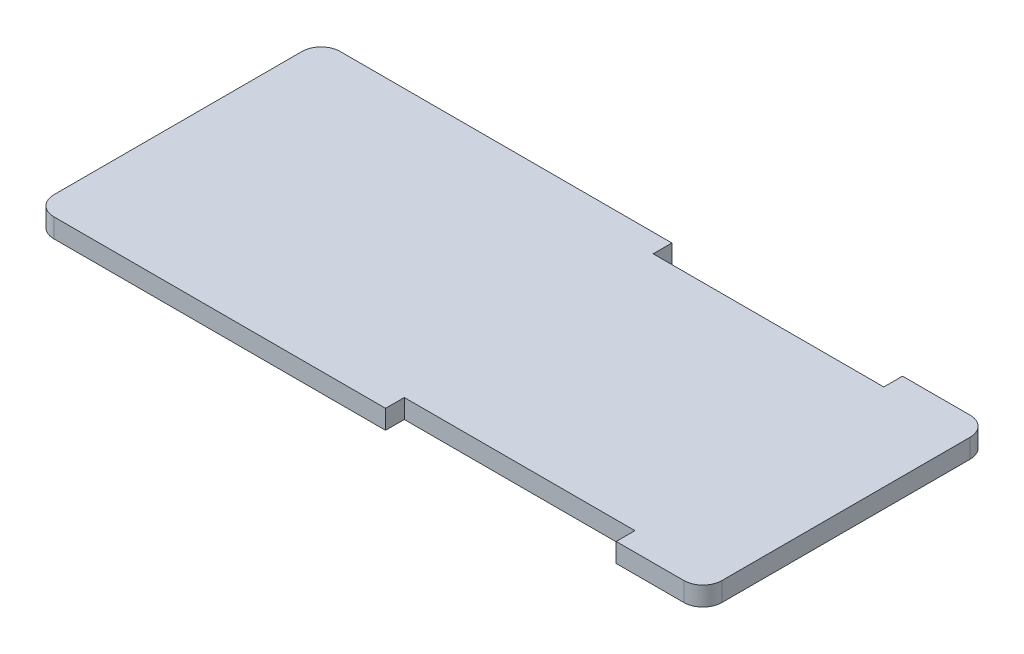
ISO-10303-21;
HEADER;
FILE_DESCRIPTION(('STEP AP214'),'2;1');
FILE_NAME('part.step','',(''),(''),'','','');
FILE_SCHEMA(('AUTOMOTIVE_DESIGN { 1 0 10303 214 1 1 1 1 }'));
ENDSEC;
DATA;
#1=APPLICATION_CONTEXT('core data for automotive mechanical design processes');
#2=APPLICATION_PROTOCOL_DEFINITION('international standard','automotive_design',2000,#1);
#3=PRODUCT_CONTEXT('',#1,'mechanical');
#4=PRODUCT('Part','Part','',(#3));
#5=PRODUCT_RELATED_PRODUCT_CATEGORY('part','',(#4));
#6=PRODUCT_DEFINITION_FORMATION('','',#4);
#7=PRODUCT_DEFINITION_CONTEXT('part definition',#1,'design');
#8=PRODUCT_DEFINITION('design','',#6,#7);
#9=PRODUCT_DEFINITION_SHAPE('','',#8);
#10=(LENGTH_UNIT() NAMED_UNIT(*) SI_UNIT(.MILLI.,.METRE.));
#11=(NAMED_UNIT(*) PLANE_ANGLE_UNIT() SI_UNIT($,.RADIAN.));
#12=(NAMED_UNIT(*) SI_UNIT($,.STERADIAN.) SOLID_ANGLE_UNIT());
#13=UNCERTAINTY_MEASURE_WITH_UNIT(LENGTH_MEASURE(1.E-05),#10,'distance_accuracy_value','');
#14=(GEOMETRIC_REPRESENTATION_CONTEXT(3) GLOBAL_UNCERTAINTY_ASSIGNED_CONTEXT((#13)) GLOBAL_UNIT_ASSIGNED_CONTEXT((#10,
#11,#12)) REPRESENTATION_CONTEXT('',''));
#15=CARTESIAN_POINT('',(0.,0.,0.));
#16=DIRECTION('',(0.,0.,1.));
#17=DIRECTION('',(1.,0.,0.));
#18=AXIS2_PLACEMENT_3D('',#15,#16,#17);
#19=CARTESIAN_POINT('',(0.,10.,150.));
#20=DIRECTION('',(0.,0.,-1.));
#21=DIRECTION('',(-1.,0.,0.));
#22=AXIS2_PLACEMENT_3D('',#19,#20,#21);
#23=PLANE('',#22);
#24=DIRECTION('',(0.,1.,0.));
#25=VECTOR('',#24,1.);
#26=CARTESIAN_POINT('',(183.760334018558,-15.,150.));
#27=LINE('',#26,#25);
#28=CARTESIAN_POINT('',(183.760334018558,0.,150.));
#29=VERTEX_POINT('',#28);
#30=CARTESIAN_POINT('',(183.760334018558,10.,150.));
#31=VERTEX_POINT('',#30);
#32=EDGE_CURVE('E151',#29,#31,#27,.T.);
#33=ORIENTED_EDGE('',*,*,#32,.T.);
#34=DIRECTION('',(1.,0.,0.));
#35=VECTOR('',#34,1.);
#36=CARTESIAN_POINT('',(0.,10.,150.));
#37=LINE('',#36,#35);
#38=CARTESIAN_POINT('',(10.,10.,150.));
#39=VERTEX_POINT('',#38);
#40=EDGE_CURVE('E166',#39,#31,#37,.T.);
#41=ORIENTED_EDGE('',*,*,#40,.F.);
#42=DIRECTION('',(0.,-1.,0.));
#43=VECTOR('',#42,1.);
#44=CARTESIAN_POINT('',(10.,10.,150.));
#45=LINE('',#44,#43);
#46=CARTESIAN_POINT('',(10.,0.,150.));
#47=VERTEX_POINT('',#46);
#48=EDGE_CURVE('E233',#39,#47,#45,.T.);
#49=ORIENTED_EDGE('',*,*,#48,.T.);
#50=DIRECTION('',(1.,0.,0.));
#51=VECTOR('',#50,1.);
#52=CARTESIAN_POINT('',(0.,0.,150.));
#53=LINE('',#52,#51);
#54=EDGE_CURVE('E169',#47,#29,#53,.T.);
#55=ORIENTED_EDGE('',*,*,#54,.T.);
#56=EDGE_LOOP('',(#33,#41,#49,#55));
#57=FACE_BOUND('',#56,.T.);
#58=ADVANCED_FACE('F37',(#57),#23,.F.);
#59=CARTESIAN_POINT('',(0.,10.,0.));
#60=DIRECTION('',(0.,0.,1.));
#61=DIRECTION('',(1.,0.,0.));
#62=AXIS2_PLACEMENT_3D('',#59,#60,#61);
#63=PLANE('',#62);
#64=DIRECTION('',(0.,1.,0.));
#65=VECTOR('',#64,1.);
#66=CARTESIAN_POINT('',(304.58142198421,-15.,0.));
#67=LINE('',#66,#65);
#68=CARTESIAN_POINT('',(304.58142198421,0.,0.));
#69=VERTEX_POINT('',#68);
#70=CARTESIAN_POINT('',(304.58142198421,10.,0.));
#71=VERTEX_POINT('',#70);
#72=EDGE_CURVE('E269',#69,#71,#67,.T.);
#73=ORIENTED_EDGE('',*,*,#72,.T.);
#74=DIRECTION('',(-1.,0.,0.));
#75=VECTOR('',#74,1.);
#76=CARTESIAN_POINT('',(0.,10.,0.));
#77=LINE('',#76,#75);
#78=CARTESIAN_POINT('',(340.,10.,0.));
#79=VERTEX_POINT('',#78);
#80=EDGE_CURVE('E187',#79,#71,#77,.T.);
#81=ORIENTED_EDGE('',*,*,#80,.F.);
#82=DIRECTION('',(0.,-1.,0.));
#83=VECTOR('',#82,1.);
#84=CARTESIAN_POINT('',(340.,10.,0.));
#85=LINE('',#84,#83);
#86=CARTESIAN_POINT('',(340.,0.,0.));
#87=VERTEX_POINT('',#86);
#88=EDGE_CURVE('E217',#79,#87,#85,.T.);
#89=ORIENTED_EDGE('',*,*,#88,.T.);
#90=DIRECTION('',(-1.,0.,0.));
#91=VECTOR('',#90,1.);
#92=CARTESIAN_POINT('',(0.,0.,0.));
#93=LINE('',#92,#91);
#94=EDGE_CURVE('E200',#87,#69,#93,.T.);
#95=ORIENTED_EDGE('',*,*,#94,.T.);
#96=EDGE_LOOP('',(#73,#81,#89,#95));
#97=FACE_BOUND('',#96,.T.);
#98=ADVANCED_FACE('F276',(#97),#63,.F.);
#99=CARTESIAN_POINT('',(0.,10.,0.));
#100=DIRECTION('',(0.,1.,0.));
#101=DIRECTION('',(0.,0.,1.));
#102=AXIS2_PLACEMENT_3D('',#99,#100,#101);
#103=PLANE('',#102);
#104=ORIENTED_EDGE('',*,*,#40,.T.);
#105=DIRECTION('',(0.,0.,-1.));
#106=VECTOR('',#105,1.);
#107=CARTESIAN_POINT('',(183.760334018558,10.,0.));
#108=LINE('',#107,#106);
#109=CARTESIAN_POINT('',(183.760334018558,10.,140.183233788463));
#110=VERTEX_POINT('',#109);
#111=EDGE_CURVE('E148',#31,#110,#108,.T.);
#112=ORIENTED_EDGE('',*,*,#111,.T.);
#113=DIRECTION('',(-1.,0.,0.));
#114=VECTOR('',#113,1.);
#115=CARTESIAN_POINT('',(0.,10.,140.183233788463));
#116=LINE('',#115,#114);
#117=CARTESIAN_POINT('',(304.58142198421,10.,140.183233788463));
#118=VERTEX_POINT('',#117);
#119=EDGE_CURVE('E171',#118,#110,#116,.T.);
#120=ORIENTED_EDGE('',*,*,#119,.F.);
#121=DIRECTION('',(0.,0.,-1.));
#122=VECTOR('',#121,1.);
#123=CARTESIAN_POINT('',(304.58142198421,10.,0.));
#124=LINE('',#123,#122);
#125=CARTESIAN_POINT('',(304.58142198421,10.,150.));
#126=VERTEX_POINT('',#125);
#127=EDGE_CURVE('E159',#126,#118,#124,.T.);
#128=ORIENTED_EDGE('',*,*,#127,.F.);
#129=CARTESIAN_POINT('',(340.,10.,150.));
#130=VERTEX_POINT('',#129);
#131=EDGE_CURVE('E178',#126,#130,#37,.T.);
#132=ORIENTED_EDGE('',*,*,#131,.T.);
#133=CARTESIAN_POINT('',(340.,10.,140.));
#134=DIRECTION('',(0.,1.,0.));
#135=DIRECTION('',(0.,0.,1.));
#136=AXIS2_PLACEMENT_3D('',#133,#134,#135);
#137=CIRCLE('',#136,10.);
#138=CARTESIAN_POINT('',(350.,10.,140.));
#139=VERTEX_POINT('',#138);
#140=EDGE_CURVE('E223',#130,#139,#137,.T.);
#141=ORIENTED_EDGE('',*,*,#140,.T.);
#142=DIRECTION('',(0.,0.,-1.));
#143=VECTOR('',#142,1.);
#144=CARTESIAN_POINT('',(350.,10.,0.));
#145=LINE('',#144,#143);
#146=CARTESIAN_POINT('',(350.,10.,10.));
#147=VERTEX_POINT('',#146);
#148=EDGE_CURVE('E177',#139,#147,#145,.T.);
#149=ORIENTED_EDGE('',*,*,#148,.T.);
#150=CARTESIAN_POINT('',(340.,10.,10.));
#151=DIRECTION('',(0.,1.,0.));
#152=DIRECTION('',(0.,0.,1.));
#153=AXIS2_PLACEMENT_3D('',#150,#151,#152);
#154=CIRCLE('',#153,10.);
#155=EDGE_CURVE('E225',#147,#79,#154,.T.);
#156=ORIENTED_EDGE('',*,*,#155,.T.);
#157=ORIENTED_EDGE('',*,*,#80,.T.);
#158=DIRECTION('',(0.,0.,1.));
#159=VECTOR('',#158,1.);
#160=CARTESIAN_POINT('',(304.58142198421,10.,0.));
#161=LINE('',#160,#159);
#162=CARTESIAN_POINT('',(304.58142198421,10.,9.81676621153724));
#163=VERTEX_POINT('',#162);
#164=EDGE_CURVE('E261',#71,#163,#161,.T.);
#165=ORIENTED_EDGE('',*,*,#164,.T.);
#166=DIRECTION('',(-1.,0.,0.));
#167=VECTOR('',#166,1.);
#168=CARTESIAN_POINT('',(0.,10.,9.81676621153724));
#169=LINE('',#168,#167);
#170=CARTESIAN_POINT('',(183.760334018558,10.,9.81676621153724));
#171=VERTEX_POINT('',#170);
#172=EDGE_CURVE('E266',#163,#171,#169,.T.);
#173=ORIENTED_EDGE('',*,*,#172,.T.);
#174=DIRECTION('',(0.,0.,1.));
#175=VECTOR('',#174,1.);
#176=CARTESIAN_POINT('',(183.760334018558,10.,0.));
#177=LINE('',#176,#175);
#178=CARTESIAN_POINT('',(183.760334018558,10.,0.));
#179=VERTEX_POINT('',#178);
#180=EDGE_CURVE('E264',#179,#171,#177,.T.);
#181=ORIENTED_EDGE('',*,*,#180,.F.);
#182=CARTESIAN_POINT('',(10.,10.,0.));
#183=VERTEX_POINT('',#182);
#184=EDGE_CURVE('E181',#179,#183,#77,.T.);
#185=ORIENTED_EDGE('',*,*,#184,.T.);
#186=CARTESIAN_POINT('',(10.,10.,10.));
#187=DIRECTION('',(0.,1.,0.));
#188=DIRECTION('',(0.,0.,1.));
#189=AXIS2_PLACEMENT_3D('',#186,#187,#188);
#190=CIRCLE('',#189,10.);
#191=CARTESIAN_POINT('',(0.,10.,10.));
#192=VERTEX_POINT('',#191);
#193=EDGE_CURVE('E228',#183,#192,#190,.T.);
#194=ORIENTED_EDGE('',*,*,#193,.T.);
#195=DIRECTION('',(0.,0.,1.));
#196=VECTOR('',#195,1.);
#197=CARTESIAN_POINT('',(0.,10.,0.));
#198=LINE('',#197,#196);
#199=CARTESIAN_POINT('',(0.,10.,140.));
#200=VERTEX_POINT('',#199);
#201=EDGE_CURVE('E183',#192,#200,#198,.T.);
#202=ORIENTED_EDGE('',*,*,#201,.T.);
#203=CARTESIAN_POINT('',(10.,10.,140.));
#204=DIRECTION('',(0.,1.,0.));
#205=DIRECTION('',(0.,0.,1.));
#206=AXIS2_PLACEMENT_3D('',#203,#204,#205);
#207=CIRCLE('',#206,10.);
#208=EDGE_CURVE('E176',#200,#39,#207,.T.);
#209=ORIENTED_EDGE('',*,*,#208,.T.);
#210=EDGE_LOOP('',(#104,#112,#120,#128,#132,#141,#149,#156,#157,#165,#173,#181,#185,#194,#202,#209));
#211=FACE_BOUND('',#210,.T.);
#212=ADVANCED_FACE('F173',(#211),#103,.T.);
#213=CARTESIAN_POINT('',(0.,0.,0.));
#214=DIRECTION('',(0.,1.,0.));
#215=DIRECTION('',(0.,0.,1.));
#216=AXIS2_PLACEMENT_3D('',#213,#214,#215);
#217=PLANE('',#216);
#218=DIRECTION('',(0.,0.,-1.));
#219=VECTOR('',#218,1.);
#220=CARTESIAN_POINT('',(183.760334018558,0.,0.));
#221=LINE('',#220,#219);
#222=CARTESIAN_POINT('',(183.760334018558,0.,140.183233788463));
#223=VERTEX_POINT('',#222);
#224=EDGE_CURVE('E11',#29,#223,#221,.T.);
#225=ORIENTED_EDGE('',*,*,#224,.F.);
#226=ORIENTED_EDGE('',*,*,#54,.F.);
#227=CARTESIAN_POINT('',(10.,0.,140.));
#228=DIRECTION('',(0.,1.,0.));
#229=DIRECTION('',(0.,0.,1.));
#230=AXIS2_PLACEMENT_3D('',#227,#228,#229);
#231=CIRCLE('',#230,10.);
#232=CARTESIAN_POINT('',(0.,0.,140.));
#233=VERTEX_POINT('',#232);
#234=EDGE_CURVE('E212',#47,#233,#231,.F.);
#235=ORIENTED_EDGE('',*,*,#234,.T.);
#236=DIRECTION('',(0.,0.,1.));
#237=VECTOR('',#236,1.);
#238=CARTESIAN_POINT('',(0.,0.,0.));
#239=LINE('',#238,#237);
#240=CARTESIAN_POINT('',(0.,0.,10.));
#241=VERTEX_POINT('',#240);
#242=EDGE_CURVE('E191',#241,#233,#239,.T.);
#243=ORIENTED_EDGE('',*,*,#242,.F.);
#244=CARTESIAN_POINT('',(10.,0.,10.));
#245=DIRECTION('',(0.,1.,0.));
#246=DIRECTION('',(0.,0.,1.));
#247=AXIS2_PLACEMENT_3D('',#244,#245,#246);
#248=CIRCLE('',#247,10.);
#249=CARTESIAN_POINT('',(10.,0.,0.));
#250=VERTEX_POINT('',#249);
#251=EDGE_CURVE('E214',#241,#250,#248,.F.);
#252=ORIENTED_EDGE('',*,*,#251,.T.);
#253=CARTESIAN_POINT('',(183.760334018558,0.,0.));
#254=VERTEX_POINT('',#253);
#255=EDGE_CURVE('E199',#254,#250,#93,.T.);
#256=ORIENTED_EDGE('',*,*,#255,.F.);
#257=DIRECTION('',(0.,0.,1.));
#258=VECTOR('',#257,1.);
#259=CARTESIAN_POINT('',(183.760334018558,0.,0.));
#260=LINE('',#259,#258);
#261=CARTESIAN_POINT('',(183.760334018558,0.,9.81676621153724));
#262=VERTEX_POINT('',#261);
#263=EDGE_CURVE('E240',#254,#262,#260,.T.);
#264=ORIENTED_EDGE('',*,*,#263,.T.);
#265=DIRECTION('',(-1.,0.,0.));
#266=VECTOR('',#265,1.);
#267=CARTESIAN_POINT('',(0.,0.,9.81676621153724));
#268=LINE('',#267,#266);
#269=CARTESIAN_POINT('',(304.58142198421,0.,9.81676621153724));
#270=VERTEX_POINT('',#269);
#271=EDGE_CURVE('E243',#270,#262,#268,.T.);
#272=ORIENTED_EDGE('',*,*,#271,.F.);
#273=DIRECTION('',(0.,0.,1.));
#274=VECTOR('',#273,1.);
#275=CARTESIAN_POINT('',(304.58142198421,0.,0.));
#276=LINE('',#275,#274);
#277=EDGE_CURVE('E245',#69,#270,#276,.T.);
#278=ORIENTED_EDGE('',*,*,#277,.F.);
#279=ORIENTED_EDGE('',*,*,#94,.F.);
#280=CARTESIAN_POINT('',(340.,0.,10.));
#281=DIRECTION('',(0.,1.,0.));
#282=DIRECTION('',(0.,0.,1.));
#283=AXIS2_PLACEMENT_3D('',#280,#281,#282);
#284=CIRCLE('',#283,10.);
#285=CARTESIAN_POINT('',(350.,0.,10.));
#286=VERTEX_POINT('',#285);
#287=EDGE_CURVE('E210',#87,#286,#284,.F.);
#288=ORIENTED_EDGE('',*,*,#287,.T.);
#289=DIRECTION('',(0.,0.,-1.));
#290=VECTOR('',#289,1.);
#291=CARTESIAN_POINT('',(350.,0.,0.));
#292=LINE('',#291,#290);
#293=CARTESIAN_POINT('',(350.,0.,140.));
#294=VERTEX_POINT('',#293);
#295=EDGE_CURVE('E196',#294,#286,#292,.T.);
#296=ORIENTED_EDGE('',*,*,#295,.F.);
#297=CARTESIAN_POINT('',(340.,0.,140.));
#298=DIRECTION('',(0.,1.,0.));
#299=DIRECTION('',(0.,0.,1.));
#300=AXIS2_PLACEMENT_3D('',#297,#298,#299);
#301=CIRCLE('',#300,10.);
#302=CARTESIAN_POINT('',(340.,0.,150.));
#303=VERTEX_POINT('',#302);
#304=EDGE_CURVE('E207',#294,#303,#301,.F.);
#305=ORIENTED_EDGE('',*,*,#304,.T.);
#306=CARTESIAN_POINT('',(304.58142198421,0.,150.));
#307=VERTEX_POINT('',#306);
#308=EDGE_CURVE('E194',#307,#303,#53,.T.);
#309=ORIENTED_EDGE('',*,*,#308,.F.);
#310=DIRECTION('',(0.,0.,-1.));
#311=VECTOR('',#310,1.);
#312=CARTESIAN_POINT('',(304.58142198421,0.,0.));
#313=LINE('',#312,#311);
#314=CARTESIAN_POINT('',(304.58142198421,0.,140.183233788463));
#315=VERTEX_POINT('',#314);
#316=EDGE_CURVE('E247',#307,#315,#313,.T.);
#317=ORIENTED_EDGE('',*,*,#316,.T.);
#318=DIRECTION('',(-1.,0.,0.));
#319=VECTOR('',#318,1.);
#320=CARTESIAN_POINT('',(0.,0.,140.183233788463));
#321=LINE('',#320,#319);
#322=EDGE_CURVE('E45',#315,#223,#321,.T.);
#323=ORIENTED_EDGE('',*,*,#322,.T.);
#324=EDGE_LOOP('',(#225,#226,#235,#243,#252,#256,#264,#272,#278,#279,#288,#296,#305,#309,#317,#323));
#325=FACE_BOUND('',#324,.T.);
#326=ADVANCED_FACE('F251',(#325),#217,.F.);
#327=CARTESIAN_POINT('',(0.,10.,0.));
#328=DIRECTION('',(1.,0.,0.));
#329=DIRECTION('',(0.,0.,-1.));
#330=AXIS2_PLACEMENT_3D('',#327,#328,#329);
#331=PLANE('',#330);
#332=ORIENTED_EDGE('',*,*,#201,.F.);
#333=DIRECTION('',(0.,-1.,0.));
#334=VECTOR('',#333,1.);
#335=CARTESIAN_POINT('',(0.,10.,10.));
#336=LINE('',#335,#334);
#337=EDGE_CURVE('E204',#192,#241,#336,.T.);
#338=ORIENTED_EDGE('',*,*,#337,.T.);
#339=ORIENTED_EDGE('',*,*,#242,.T.);
#340=DIRECTION('',(0.,-1.,0.));
#341=VECTOR('',#340,1.);
#342=CARTESIAN_POINT('',(0.,10.,140.));
#343=LINE('',#342,#341);
#344=EDGE_CURVE('E190',#233,#200,#343,.F.);
#345=ORIENTED_EDGE('',*,*,#344,.T.);
#346=EDGE_LOOP('',(#332,#338,#339,#345));
#347=FACE_BOUND('',#346,.T.);
#348=ADVANCED_FACE('F306',(#347),#331,.F.);
#349=ORIENTED_EDGE('',*,*,#131,.F.);
#350=DIRECTION('',(0.,1.,0.));
#351=VECTOR('',#350,1.);
#352=CARTESIAN_POINT('',(304.58142198421,-15.,150.));
#353=LINE('',#352,#351);
#354=EDGE_CURVE('E170',#307,#126,#353,.T.);
#355=ORIENTED_EDGE('',*,*,#354,.F.);
#356=ORIENTED_EDGE('',*,*,#308,.T.);
#357=DIRECTION('',(0.,-1.,0.));
#358=VECTOR('',#357,1.);
#359=CARTESIAN_POINT('',(340.,10.,150.));
#360=LINE('',#359,#358);
#361=EDGE_CURVE('E230',#303,#130,#360,.F.);
#362=ORIENTED_EDGE('',*,*,#361,.T.);
#363=EDGE_LOOP('',(#349,#355,#356,#362));
#364=FACE_BOUND('',#363,.T.);
#365=ADVANCED_FACE('F323',(#364),#23,.F.);
#366=CARTESIAN_POINT('',(350.,10.,0.));
#367=DIRECTION('',(-1.,0.,0.));
#368=DIRECTION('',(0.,0.,1.));
#369=AXIS2_PLACEMENT_3D('',#366,#367,#368);
#370=PLANE('',#369);
#371=ORIENTED_EDGE('',*,*,#295,.T.);
#372=DIRECTION('',(0.,-1.,0.));
#373=VECTOR('',#372,1.);
#374=CARTESIAN_POINT('',(350.,10.,10.));
#375=LINE('',#374,#373);
#376=EDGE_CURVE('E238',#286,#147,#375,.F.);
#377=ORIENTED_EDGE('',*,*,#376,.T.);
#378=ORIENTED_EDGE('',*,*,#148,.F.);
#379=DIRECTION('',(0.,-1.,0.));
#380=VECTOR('',#379,1.);
#381=CARTESIAN_POINT('',(350.,10.,140.));
#382=LINE('',#381,#380);
#383=EDGE_CURVE('E235',#139,#294,#382,.T.);
#384=ORIENTED_EDGE('',*,*,#383,.T.);
#385=EDGE_LOOP('',(#371,#377,#378,#384));
#386=FACE_BOUND('',#385,.T.);
#387=ADVANCED_FACE('F331',(#386),#370,.F.);
#388=ORIENTED_EDGE('',*,*,#184,.F.);
#389=DIRECTION('',(0.,1.,0.));
#390=VECTOR('',#389,1.);
#391=CARTESIAN_POINT('',(183.760334018558,-15.,0.));
#392=LINE('',#391,#390);
#393=EDGE_CURVE('E272',#254,#179,#392,.T.);
#394=ORIENTED_EDGE('',*,*,#393,.F.);
#395=ORIENTED_EDGE('',*,*,#255,.T.);
#396=DIRECTION('',(0.,-1.,0.));
#397=VECTOR('',#396,1.);
#398=CARTESIAN_POINT('',(10.,10.,0.));
#399=LINE('',#398,#397);
#400=EDGE_CURVE('E220',#250,#183,#399,.F.);
#401=ORIENTED_EDGE('',*,*,#400,.T.);
#402=EDGE_LOOP('',(#388,#394,#395,#401));
#403=FACE_BOUND('',#402,.T.);
#404=ADVANCED_FACE('F297',(#403),#63,.F.);
#405=CARTESIAN_POINT('',(10.,10.,10.));
#406=DIRECTION('',(0.,-1.,0.));
#407=DIRECTION('',(0.,0.,-1.));
#408=AXIS2_PLACEMENT_3D('',#405,#406,#407);
#409=CYLINDRICAL_SURFACE('',#408,10.);
#410=ORIENTED_EDGE('',*,*,#193,.F.);
#411=ORIENTED_EDGE('',*,*,#400,.F.);
#412=ORIENTED_EDGE('',*,*,#251,.F.);
#413=ORIENTED_EDGE('',*,*,#337,.F.);
#414=EDGE_LOOP('',(#410,#411,#412,#413));
#415=FACE_BOUND('',#414,.T.);
#416=ADVANCED_FACE('F303',(#415),#409,.T.);
#417=CARTESIAN_POINT('',(10.,10.,140.));
#418=DIRECTION('',(0.,-1.,0.));
#419=DIRECTION('',(0.,0.,-1.));
#420=AXIS2_PLACEMENT_3D('',#417,#418,#419);
#421=CYLINDRICAL_SURFACE('',#420,10.);
#422=ORIENTED_EDGE('',*,*,#208,.F.);
#423=ORIENTED_EDGE('',*,*,#344,.F.);
#424=ORIENTED_EDGE('',*,*,#234,.F.);
#425=ORIENTED_EDGE('',*,*,#48,.F.);
#426=EDGE_LOOP('',(#422,#423,#424,#425));
#427=FACE_BOUND('',#426,.T.);
#428=ADVANCED_FACE('F310',(#427),#421,.T.);
#429=CARTESIAN_POINT('',(340.,10.,10.));
#430=DIRECTION('',(0.,-1.,0.));
#431=DIRECTION('',(0.,0.,-1.));
#432=AXIS2_PLACEMENT_3D('',#429,#430,#431);
#433=CYLINDRICAL_SURFACE('',#432,10.);
#434=ORIENTED_EDGE('',*,*,#155,.F.);
#435=ORIENTED_EDGE('',*,*,#376,.F.);
#436=ORIENTED_EDGE('',*,*,#287,.F.);
#437=ORIENTED_EDGE('',*,*,#88,.F.);
#438=EDGE_LOOP('',(#434,#435,#436,#437));
#439=FACE_BOUND('',#438,.T.);
#440=ADVANCED_FACE('F285',(#439),#433,.T.);
#441=CARTESIAN_POINT('',(340.,10.,140.));
#442=DIRECTION('',(0.,-1.,0.));
#443=DIRECTION('',(0.,0.,-1.));
#444=AXIS2_PLACEMENT_3D('',#441,#442,#443);
#445=CYLINDRICAL_SURFACE('',#444,10.);
#446=ORIENTED_EDGE('',*,*,#140,.F.);
#447=ORIENTED_EDGE('',*,*,#361,.F.);
#448=ORIENTED_EDGE('',*,*,#304,.F.);
#449=ORIENTED_EDGE('',*,*,#383,.F.);
#450=EDGE_LOOP('',(#446,#447,#448,#449));
#451=FACE_BOUND('',#450,.T.);
#452=ADVANCED_FACE('F39',(#451),#445,.T.);
#453=CARTESIAN_POINT('',(304.58142198421,-15.,0.));
#454=DIRECTION('',(-1.,0.,0.));
#455=DIRECTION('',(0.,0.,1.));
#456=AXIS2_PLACEMENT_3D('',#453,#454,#455);
#457=PLANE('',#456);
#458=ORIENTED_EDGE('',*,*,#277,.T.);
#459=DIRECTION('',(0.,1.,0.));
#460=VECTOR('',#459,1.);
#461=CARTESIAN_POINT('',(304.58142198421,-15.,9.81676621153724));
#462=LINE('',#461,#460);
#463=EDGE_CURVE('E160',#270,#163,#462,.T.);
#464=ORIENTED_EDGE('',*,*,#463,.T.);
#465=ORIENTED_EDGE('',*,*,#164,.F.);
#466=ORIENTED_EDGE('',*,*,#72,.F.);
#467=EDGE_LOOP('',(#458,#464,#465,#466));
#468=FACE_BOUND('',#467,.T.);
#469=ADVANCED_FACE('F289',(#468),#457,.T.);
#470=CARTESIAN_POINT('',(0.,-15.,9.81676621153724));
#471=DIRECTION('',(0.,0.,-1.));
#472=DIRECTION('',(-1.,0.,0.));
#473=AXIS2_PLACEMENT_3D('',#470,#471,#472);
#474=PLANE('',#473);
#475=ORIENTED_EDGE('',*,*,#271,.T.);
#476=DIRECTION('',(0.,1.,0.));
#477=VECTOR('',#476,1.);
#478=CARTESIAN_POINT('',(183.760334018558,-15.,9.81676621153724));
#479=LINE('',#478,#477);
#480=EDGE_CURVE('E60',#262,#171,#479,.T.);
#481=ORIENTED_EDGE('',*,*,#480,.T.);
#482=ORIENTED_EDGE('',*,*,#172,.F.);
#483=ORIENTED_EDGE('',*,*,#463,.F.);
#484=EDGE_LOOP('',(#475,#481,#482,#483));
#485=FACE_BOUND('',#484,.T.);
#486=ADVANCED_FACE('F292',(#485),#474,.T.);
#487=CARTESIAN_POINT('',(183.760334018558,-15.,0.));
#488=DIRECTION('',(-1.,0.,0.));
#489=DIRECTION('',(0.,0.,1.));
#490=AXIS2_PLACEMENT_3D('',#487,#488,#489);
#491=PLANE('',#490);
#492=ORIENTED_EDGE('',*,*,#393,.T.);
#493=ORIENTED_EDGE('',*,*,#180,.T.);
#494=ORIENTED_EDGE('',*,*,#480,.F.);
#495=ORIENTED_EDGE('',*,*,#263,.F.);
#496=EDGE_LOOP('',(#492,#493,#494,#495));
#497=FACE_BOUND('',#496,.T.);
#498=ADVANCED_FACE('F311',(#497),#491,.F.);
#499=CARTESIAN_POINT('',(183.760334018558,-15.,0.));
#500=DIRECTION('',(1.,0.,0.));
#501=DIRECTION('',(0.,0.,-1.));
#502=AXIS2_PLACEMENT_3D('',#499,#500,#501);
#503=PLANE('',#502);
#504=ORIENTED_EDGE('',*,*,#224,.T.);
#505=DIRECTION('',(0.,1.,0.));
#506=VECTOR('',#505,1.);
#507=CARTESIAN_POINT('',(183.760334018558,-15.,140.183233788463));
#508=LINE('',#507,#506);
#509=EDGE_CURVE('E154',#223,#110,#508,.T.);
#510=ORIENTED_EDGE('',*,*,#509,.T.);
#511=ORIENTED_EDGE('',*,*,#111,.F.);
#512=ORIENTED_EDGE('',*,*,#32,.F.);
#513=EDGE_LOOP('',(#504,#510,#511,#512));
#514=FACE_BOUND('',#513,.T.);
#515=ADVANCED_FACE('F150',(#514),#503,.T.);
#516=CARTESIAN_POINT('',(0.,-15.,140.183233788463));
#517=DIRECTION('',(0.,0.,-1.));
#518=DIRECTION('',(-1.,0.,0.));
#519=AXIS2_PLACEMENT_3D('',#516,#517,#518);
#520=PLANE('',#519);
#521=DIRECTION('',(0.,1.,0.));
#522=VECTOR('',#521,1.);
#523=CARTESIAN_POINT('',(304.58142198421,-15.,140.183233788463));
#524=LINE('',#523,#522);
#525=EDGE_CURVE('E52',#315,#118,#524,.T.);
#526=ORIENTED_EDGE('',*,*,#525,.T.);
#527=ORIENTED_EDGE('',*,*,#119,.T.);
#528=ORIENTED_EDGE('',*,*,#509,.F.);
#529=ORIENTED_EDGE('',*,*,#322,.F.);
#530=EDGE_LOOP('',(#526,#527,#528,#529));
#531=FACE_BOUND('',#530,.T.);
#532=ADVANCED_FACE('F254',(#531),#520,.F.);
#533=CARTESIAN_POINT('',(304.58142198421,-15.,0.));
#534=DIRECTION('',(1.,0.,0.));
#535=DIRECTION('',(0.,0.,-1.));
#536=AXIS2_PLACEMENT_3D('',#533,#534,#535);
#537=PLANE('',#536);
#538=ORIENTED_EDGE('',*,*,#354,.T.);
#539=ORIENTED_EDGE('',*,*,#127,.T.);
#540=ORIENTED_EDGE('',*,*,#525,.F.);
#541=ORIENTED_EDGE('',*,*,#316,.F.);
#542=EDGE_LOOP('',(#538,#539,#540,#541));
#543=FACE_BOUND('',#542,.T.);
#544=ADVANCED_FACE('F343',(#543),#537,.F.);
#545=CLOSED_SHELL('',(#58,#98,#212,#326,#348,#365,#387,#404,#416,#428,#440,#452,#469,#486,#498,
#515,#532,#544));
#546=MANIFOLD_SOLID_BREP('B2',#545);
#547=ADVANCED_BREP_SHAPE_REPRESENTATION('',(#18,#546),#14);
#548=SHAPE_DEFINITION_REPRESENTATION(#9,#547);
ENDSEC;
END-ISO-10303-21;
